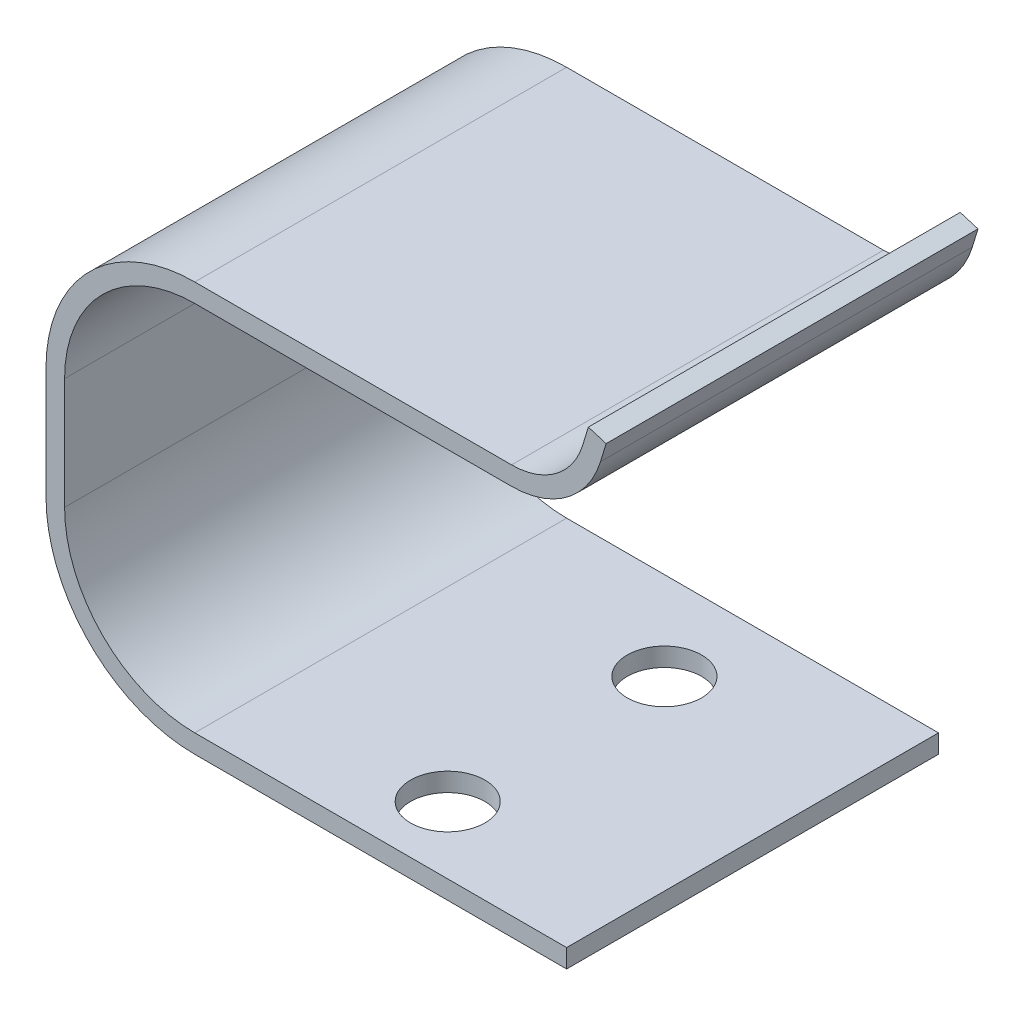
ISO-10303-21;
HEADER;
FILE_DESCRIPTION(('STEP AP214'),'2;1');
FILE_NAME('part.step','',(''),(''),'','','');
FILE_SCHEMA(('AUTOMOTIVE_DESIGN { 1 0 10303 214 1 1 1 1 }'));
ENDSEC;
DATA;
#1=APPLICATION_CONTEXT('core data for automotive mechanical design processes');
#2=APPLICATION_PROTOCOL_DEFINITION('international standard','automotive_design',2000,#1);
#3=PRODUCT_CONTEXT('',#1,'mechanical');
#4=PRODUCT('Part','Part','',(#3));
#5=PRODUCT_RELATED_PRODUCT_CATEGORY('part','',(#4));
#6=PRODUCT_DEFINITION_FORMATION('','',#4);
#7=PRODUCT_DEFINITION_CONTEXT('part definition',#1,'design');
#8=PRODUCT_DEFINITION('design','',#6,#7);
#9=PRODUCT_DEFINITION_SHAPE('','',#8);
#10=(LENGTH_UNIT() NAMED_UNIT(*) SI_UNIT(.MILLI.,.METRE.));
#11=(NAMED_UNIT(*) PLANE_ANGLE_UNIT() SI_UNIT($,.RADIAN.));
#12=(NAMED_UNIT(*) SI_UNIT($,.STERADIAN.) SOLID_ANGLE_UNIT());
#13=UNCERTAINTY_MEASURE_WITH_UNIT(LENGTH_MEASURE(1.E-05),#10,'distance_accuracy_value','');
#14=(GEOMETRIC_REPRESENTATION_CONTEXT(3) GLOBAL_UNCERTAINTY_ASSIGNED_CONTEXT((#13)) GLOBAL_UNIT_ASSIGNED_CONTEXT((#10,
#11,#12)) REPRESENTATION_CONTEXT('',''));
#15=CARTESIAN_POINT('',(0.,0.,0.));
#16=DIRECTION('',(0.,0.,1.));
#17=DIRECTION('',(1.,0.,0.));
#18=AXIS2_PLACEMENT_3D('',#15,#16,#17);
#19=CARTESIAN_POINT('',(1.82101102577767,24.5400968701397,20.));
#20=DIRECTION('',(-0.956424233307041,0.291980625972067,0.));
#21=DIRECTION('',(-0.291980625972067,-0.956424233307041,0.));
#22=AXIS2_PLACEMENT_3D('',#19,#20,#21);
#23=PLANE('',#22);
#24=DIRECTION('',(0.291980625972067,0.956424233307041,0.));
#25=VECTOR('',#24,1.);
#26=CARTESIAN_POINT('',(1.82101102577767,24.5400968701397,0.));
#27=LINE('',#26,#25);
#28=CARTESIAN_POINT('',(1.82101102577767,24.5400968701397,0.));
#29=VERTEX_POINT('',#28);
#30=CARTESIAN_POINT('',(2.12434673719531,25.5337163072561,0.));
#31=VERTEX_POINT('',#30);
#32=EDGE_CURVE('E178',#29,#31,#27,.T.);
#33=ORIENTED_EDGE('',*,*,#32,.T.);
#34=DIRECTION('',(0.,0.,-1.));
#35=VECTOR('',#34,1.);
#36=CARTESIAN_POINT('',(2.12434673719531,25.5337163072561,20.));
#37=LINE('',#36,#35);
#38=CARTESIAN_POINT('',(2.12434673719531,25.5337163072561,20.));
#39=VERTEX_POINT('',#38);
#40=EDGE_CURVE('E11',#39,#31,#37,.T.);
#41=ORIENTED_EDGE('',*,*,#40,.F.);
#42=DIRECTION('',(0.291980625972067,0.956424233307041,0.));
#43=VECTOR('',#42,1.);
#44=CARTESIAN_POINT('',(1.82101102577767,24.5400968701397,20.));
#45=LINE('',#44,#43);
#46=CARTESIAN_POINT('',(1.82101102577767,24.5400968701397,20.));
#47=VERTEX_POINT('',#46);
#48=EDGE_CURVE('E115',#47,#39,#45,.T.);
#49=ORIENTED_EDGE('',*,*,#48,.F.);
#50=DIRECTION('',(0.,0.,-1.));
#51=VECTOR('',#50,1.);
#52=CARTESIAN_POINT('',(1.82101102577767,24.5400968701397,20.));
#53=LINE('',#52,#51);
#54=EDGE_CURVE('E174',#47,#29,#53,.T.);
#55=ORIENTED_EDGE('',*,*,#54,.T.);
#56=EDGE_LOOP('',(#33,#41,#49,#55));
#57=FACE_BOUND('',#56,.T.);
#58=ADVANCED_FACE('F33',(#57),#23,.F.);
#59=CARTESIAN_POINT('',(1.16792250388827,25.8256969332282,20.));
#60=DIRECTION('',(0.291980625972067,0.956424233307041,0.));
#61=DIRECTION('',(-0.956424233307041,0.291980625972067,0.));
#62=AXIS2_PLACEMENT_3D('',#59,#60,#61);
#63=PLANE('',#62);
#64=DIRECTION('',(0.956424233307041,-0.291980625972067,0.));
#65=VECTOR('',#64,1.);
#66=CARTESIAN_POINT('',(1.16792250388827,25.8256969332282,0.));
#67=LINE('',#66,#65);
#68=CARTESIAN_POINT('',(1.16792250388827,25.8256969332282,0.));
#69=VERTEX_POINT('',#68);
#70=EDGE_CURVE('E181',#69,#31,#67,.T.);
#71=ORIENTED_EDGE('',*,*,#70,.F.);
#72=DIRECTION('',(0.,0.,-1.));
#73=VECTOR('',#72,1.);
#74=CARTESIAN_POINT('',(1.16792250388827,25.8256969332282,20.));
#75=LINE('',#74,#73);
#76=CARTESIAN_POINT('',(1.16792250388827,25.8256969332282,20.));
#77=VERTEX_POINT('',#76);
#78=EDGE_CURVE('E42',#77,#69,#75,.T.);
#79=ORIENTED_EDGE('',*,*,#78,.F.);
#80=DIRECTION('',(0.956424233307041,-0.291980625972067,0.));
#81=VECTOR('',#80,1.);
#82=CARTESIAN_POINT('',(1.16792250388827,25.8256969332282,20.));
#83=LINE('',#82,#81);
#84=EDGE_CURVE('E256',#77,#39,#83,.T.);
#85=ORIENTED_EDGE('',*,*,#84,.T.);
#86=ORIENTED_EDGE('',*,*,#40,.T.);
#87=EDGE_LOOP('',(#71,#79,#85,#86));
#88=FACE_BOUND('',#87,.T.);
#89=ADVANCED_FACE('F313',(#88),#63,.T.);
#90=CARTESIAN_POINT('',(0.864586792470628,24.8320774961118,20.));
#91=DIRECTION('',(-0.956424233307041,0.291980625972067,0.));
#92=DIRECTION('',(-0.291980625972067,-0.956424233307041,0.));
#93=AXIS2_PLACEMENT_3D('',#90,#91,#92);
#94=PLANE('',#93);
#95=DIRECTION('',(0.291980625972067,0.956424233307041,0.));
#96=VECTOR('',#95,1.);
#97=CARTESIAN_POINT('',(0.864586792470628,24.8320774961118,0.));
#98=LINE('',#97,#96);
#99=CARTESIAN_POINT('',(0.864586792470629,24.8320774961118,0.));
#100=VERTEX_POINT('',#99);
#101=EDGE_CURVE('E185',#100,#69,#98,.T.);
#102=ORIENTED_EDGE('',*,*,#101,.F.);
#103=DIRECTION('',(0.,0.,-1.));
#104=VECTOR('',#103,1.);
#105=CARTESIAN_POINT('',(0.864586792470629,24.8320774961118,20.));
#106=LINE('',#105,#104);
#107=CARTESIAN_POINT('',(0.864586792470629,24.8320774961118,20.));
#108=VERTEX_POINT('',#107);
#109=EDGE_CURVE('E241',#108,#100,#106,.T.);
#110=ORIENTED_EDGE('',*,*,#109,.F.);
#111=DIRECTION('',(0.291980625972067,0.956424233307041,0.));
#112=VECTOR('',#111,1.);
#113=CARTESIAN_POINT('',(0.864586792470628,24.8320774961118,20.));
#114=LINE('',#113,#112);
#115=EDGE_CURVE('E259',#108,#77,#114,.T.);
#116=ORIENTED_EDGE('',*,*,#115,.T.);
#117=ORIENTED_EDGE('',*,*,#78,.T.);
#118=EDGE_LOOP('',(#102,#110,#116,#117));
#119=FACE_BOUND('',#118,.T.);
#120=ADVANCED_FACE('F317',(#119),#94,.T.);
#121=CARTESIAN_POINT('',(-2.96111014075754,26.,20.));
#122=DIRECTION('',(0.,0.,-1.));
#123=DIRECTION('',(-1.,0.,0.));
#124=AXIS2_PLACEMENT_3D('',#121,#122,#123);
#125=CYLINDRICAL_SURFACE('',#124,4.);
#126=CARTESIAN_POINT('',(-2.96111014075754,26.,0.));
#127=DIRECTION('',(0.,0.,1.));
#128=DIRECTION('',(-1.,0.,0.));
#129=AXIS2_PLACEMENT_3D('',#126,#127,#128);
#130=CIRCLE('',#129,4.);
#131=CARTESIAN_POINT('',(-2.96111014075756,22.,0.));
#132=VERTEX_POINT('',#131);
#133=EDGE_CURVE('E188',#132,#100,#130,.T.);
#134=ORIENTED_EDGE('',*,*,#133,.F.);
#135=DIRECTION('',(0.,0.,-1.));
#136=VECTOR('',#135,1.);
#137=CARTESIAN_POINT('',(-2.96111014075756,22.,20.));
#138=LINE('',#137,#136);
#139=CARTESIAN_POINT('',(-2.96111014075756,22.,20.));
#140=VERTEX_POINT('',#139);
#141=EDGE_CURVE('E239',#140,#132,#138,.T.);
#142=ORIENTED_EDGE('',*,*,#141,.F.);
#143=CARTESIAN_POINT('',(-2.96111014075754,26.,20.));
#144=DIRECTION('',(0.,0.,1.));
#145=DIRECTION('',(-1.,0.,0.));
#146=AXIS2_PLACEMENT_3D('',#143,#144,#145);
#147=CIRCLE('',#146,4.);
#148=EDGE_CURVE('E262',#140,#108,#147,.T.);
#149=ORIENTED_EDGE('',*,*,#148,.T.);
#150=ORIENTED_EDGE('',*,*,#109,.T.);
#151=EDGE_LOOP('',(#134,#142,#149,#150));
#152=FACE_BOUND('',#151,.T.);
#153=ADVANCED_FACE('F322',(#152),#125,.F.);
#154=CARTESIAN_POINT('',(-20.,22.,20.));
#155=DIRECTION('',(0.,1.,0.));
#156=DIRECTION('',(0.,0.,1.));
#157=AXIS2_PLACEMENT_3D('',#154,#155,#156);
#158=PLANE('',#157);
#159=DIRECTION('',(1.,0.,0.));
#160=VECTOR('',#159,1.);
#161=CARTESIAN_POINT('',(-20.,22.,0.));
#162=LINE('',#161,#160);
#163=CARTESIAN_POINT('',(-20.,22.,0.));
#164=VERTEX_POINT('',#163);
#165=EDGE_CURVE('E191',#164,#132,#162,.T.);
#166=ORIENTED_EDGE('',*,*,#165,.F.);
#167=DIRECTION('',(0.,0.,-1.));
#168=VECTOR('',#167,1.);
#169=CARTESIAN_POINT('',(-20.,22.,20.));
#170=LINE('',#169,#168);
#171=CARTESIAN_POINT('',(-20.,22.,20.));
#172=VERTEX_POINT('',#171);
#173=EDGE_CURVE('E237',#172,#164,#170,.T.);
#174=ORIENTED_EDGE('',*,*,#173,.F.);
#175=DIRECTION('',(1.,0.,0.));
#176=VECTOR('',#175,1.);
#177=CARTESIAN_POINT('',(-20.,22.,20.));
#178=LINE('',#177,#176);
#179=EDGE_CURVE('E265',#172,#140,#178,.T.);
#180=ORIENTED_EDGE('',*,*,#179,.T.);
#181=ORIENTED_EDGE('',*,*,#141,.T.);
#182=EDGE_LOOP('',(#166,#174,#180,#181));
#183=FACE_BOUND('',#182,.T.);
#184=ADVANCED_FACE('F328',(#183),#158,.T.);
#185=CARTESIAN_POINT('',(-20.,14.,20.));
#186=DIRECTION('',(0.,0.,-1.));
#187=DIRECTION('',(-1.,0.,0.));
#188=AXIS2_PLACEMENT_3D('',#185,#186,#187);
#189=CYLINDRICAL_SURFACE('',#188,8.);
#190=CARTESIAN_POINT('',(-20.,14.,0.));
#191=DIRECTION('',(0.,0.,-1.));
#192=DIRECTION('',(-1.,0.,0.));
#193=AXIS2_PLACEMENT_3D('',#190,#191,#192);
#194=CIRCLE('',#193,8.);
#195=CARTESIAN_POINT('',(-28.,14.,0.));
#196=VERTEX_POINT('',#195);
#197=EDGE_CURVE('E194',#196,#164,#194,.T.);
#198=ORIENTED_EDGE('',*,*,#197,.F.);
#199=DIRECTION('',(0.,0.,-1.));
#200=VECTOR('',#199,1.);
#201=CARTESIAN_POINT('',(-28.,14.,20.));
#202=LINE('',#201,#200);
#203=CARTESIAN_POINT('',(-28.,14.,20.));
#204=VERTEX_POINT('',#203);
#205=EDGE_CURVE('E235',#204,#196,#202,.T.);
#206=ORIENTED_EDGE('',*,*,#205,.F.);
#207=CARTESIAN_POINT('',(-20.,14.,20.));
#208=DIRECTION('',(0.,0.,-1.));
#209=DIRECTION('',(-1.,0.,0.));
#210=AXIS2_PLACEMENT_3D('',#207,#208,#209);
#211=CIRCLE('',#210,8.);
#212=EDGE_CURVE('E268',#204,#172,#211,.T.);
#213=ORIENTED_EDGE('',*,*,#212,.T.);
#214=ORIENTED_EDGE('',*,*,#173,.T.);
#215=EDGE_LOOP('',(#198,#206,#213,#214));
#216=FACE_BOUND('',#215,.T.);
#217=ADVANCED_FACE('F332',(#216),#189,.T.);
#218=CARTESIAN_POINT('',(-28.,8.,20.));
#219=DIRECTION('',(-1.,0.,0.));
#220=DIRECTION('',(0.,0.,1.));
#221=AXIS2_PLACEMENT_3D('',#218,#219,#220);
#222=PLANE('',#221);
#223=DIRECTION('',(0.,1.,0.));
#224=VECTOR('',#223,1.);
#225=CARTESIAN_POINT('',(-28.,8.,0.));
#226=LINE('',#225,#224);
#227=CARTESIAN_POINT('',(-28.,8.,0.));
#228=VERTEX_POINT('',#227);
#229=EDGE_CURVE('E197',#228,#196,#226,.T.);
#230=ORIENTED_EDGE('',*,*,#229,.F.);
#231=DIRECTION('',(0.,0.,-1.));
#232=VECTOR('',#231,1.);
#233=CARTESIAN_POINT('',(-28.,8.,20.));
#234=LINE('',#233,#232);
#235=CARTESIAN_POINT('',(-28.,8.,20.));
#236=VERTEX_POINT('',#235);
#237=EDGE_CURVE('E233',#236,#228,#234,.T.);
#238=ORIENTED_EDGE('',*,*,#237,.F.);
#239=DIRECTION('',(0.,1.,0.));
#240=VECTOR('',#239,1.);
#241=CARTESIAN_POINT('',(-28.,8.,20.));
#242=LINE('',#241,#240);
#243=EDGE_CURVE('E271',#236,#204,#242,.T.);
#244=ORIENTED_EDGE('',*,*,#243,.T.);
#245=ORIENTED_EDGE('',*,*,#205,.T.);
#246=EDGE_LOOP('',(#230,#238,#244,#245));
#247=FACE_BOUND('',#246,.T.);
#248=ADVANCED_FACE('F336',(#247),#222,.T.);
#249=CARTESIAN_POINT('',(-20.,8.,20.));
#250=DIRECTION('',(0.,0.,-1.));
#251=DIRECTION('',(-1.,0.,0.));
#252=AXIS2_PLACEMENT_3D('',#249,#250,#251);
#253=CYLINDRICAL_SURFACE('',#252,8.);
#254=CARTESIAN_POINT('',(-20.,8.,0.));
#255=DIRECTION('',(0.,0.,-1.));
#256=DIRECTION('',(-1.,0.,0.));
#257=AXIS2_PLACEMENT_3D('',#254,#255,#256);
#258=CIRCLE('',#257,8.);
#259=CARTESIAN_POINT('',(-20.,0.,0.));
#260=VERTEX_POINT('',#259);
#261=EDGE_CURVE('E200',#260,#228,#258,.T.);
#262=ORIENTED_EDGE('',*,*,#261,.F.);
#263=DIRECTION('',(0.,0.,-1.));
#264=VECTOR('',#263,1.);
#265=CARTESIAN_POINT('',(-20.,0.,20.));
#266=LINE('',#265,#264);
#267=CARTESIAN_POINT('',(-20.,0.,20.));
#268=VERTEX_POINT('',#267);
#269=EDGE_CURVE('E231',#268,#260,#266,.T.);
#270=ORIENTED_EDGE('',*,*,#269,.F.);
#271=CARTESIAN_POINT('',(-20.,8.,20.));
#272=DIRECTION('',(0.,0.,-1.));
#273=DIRECTION('',(-1.,0.,0.));
#274=AXIS2_PLACEMENT_3D('',#271,#272,#273);
#275=CIRCLE('',#274,8.);
#276=EDGE_CURVE('E274',#268,#236,#275,.T.);
#277=ORIENTED_EDGE('',*,*,#276,.T.);
#278=ORIENTED_EDGE('',*,*,#237,.T.);
#279=EDGE_LOOP('',(#262,#270,#277,#278));
#280=FACE_BOUND('',#279,.T.);
#281=ADVANCED_FACE('F340',(#280),#253,.T.);
#282=CARTESIAN_POINT('',(0.,0.,20.));
#283=DIRECTION('',(0.,-1.,0.));
#284=DIRECTION('',(1.,0.,0.));
#285=AXIS2_PLACEMENT_3D('',#282,#283,#284);
#286=PLANE('',#285);
#287=CARTESIAN_POINT('',(-10.,0.,4.74155441829135));
#288=DIRECTION('',(0.,-1.,0.));
#289=DIRECTION('',(1.,0.,0.));
#290=AXIS2_PLACEMENT_3D('',#287,#288,#289);
#291=CIRCLE('',#290,2.);
#292=CARTESIAN_POINT('',(-8.,0.,4.74155441829135));
#293=VERTEX_POINT('',#292);
#294=EDGE_CURVE('E252',#293,#293,#291,.T.);
#295=ORIENTED_EDGE('',*,*,#294,.F.);
#296=EDGE_LOOP('',(#295));
#297=FACE_BOUND('',#296,.T.);
#298=CARTESIAN_POINT('',(-10.,0.,16.3954067885648));
#299=DIRECTION('',(0.,-1.,0.));
#300=DIRECTION('',(1.,0.,0.));
#301=AXIS2_PLACEMENT_3D('',#298,#299,#300);
#302=CIRCLE('',#301,2.);
#303=CARTESIAN_POINT('',(-8.,0.,16.3954067885648));
#304=VERTEX_POINT('',#303);
#305=EDGE_CURVE('E244',#304,#304,#302,.T.);
#306=ORIENTED_EDGE('',*,*,#305,.F.);
#307=EDGE_LOOP('',(#306));
#308=FACE_BOUND('',#307,.T.);
#309=DIRECTION('',(-1.,0.,0.));
#310=VECTOR('',#309,1.);
#311=CARTESIAN_POINT('',(0.,0.,0.));
#312=LINE('',#311,#310);
#313=CARTESIAN_POINT('',(0.,0.,0.));
#314=VERTEX_POINT('',#313);
#315=EDGE_CURVE('E203',#314,#260,#312,.T.);
#316=ORIENTED_EDGE('',*,*,#315,.F.);
#317=DIRECTION('',(0.,0.,-1.));
#318=VECTOR('',#317,1.);
#319=CARTESIAN_POINT('',(0.,0.,20.));
#320=LINE('',#319,#318);
#321=CARTESIAN_POINT('',(0.,0.,20.));
#322=VERTEX_POINT('',#321);
#323=EDGE_CURVE('E229',#322,#314,#320,.T.);
#324=ORIENTED_EDGE('',*,*,#323,.F.);
#325=DIRECTION('',(-1.,0.,0.));
#326=VECTOR('',#325,1.);
#327=CARTESIAN_POINT('',(0.,0.,20.));
#328=LINE('',#327,#326);
#329=EDGE_CURVE('E277',#322,#268,#328,.T.);
#330=ORIENTED_EDGE('',*,*,#329,.T.);
#331=ORIENTED_EDGE('',*,*,#269,.T.);
#332=EDGE_LOOP('',(#316,#324,#330,#331));
#333=FACE_BOUND('',#332,.T.);
#334=ADVANCED_FACE('F344',(#297,#308,#333),#286,.T.);
#335=CARTESIAN_POINT('',(0.,1.,20.));
#336=DIRECTION('',(1.,0.,0.));
#337=DIRECTION('',(0.,1.,0.));
#338=AXIS2_PLACEMENT_3D('',#335,#336,#337);
#339=PLANE('',#338);
#340=DIRECTION('',(0.,-1.,0.));
#341=VECTOR('',#340,1.);
#342=CARTESIAN_POINT('',(0.,1.,0.));
#343=LINE('',#342,#341);
#344=CARTESIAN_POINT('',(0.,1.,0.));
#345=VERTEX_POINT('',#344);
#346=EDGE_CURVE('E206',#345,#314,#343,.T.);
#347=ORIENTED_EDGE('',*,*,#346,.F.);
#348=DIRECTION('',(0.,0.,-1.));
#349=VECTOR('',#348,1.);
#350=CARTESIAN_POINT('',(0.,1.,20.));
#351=LINE('',#350,#349);
#352=CARTESIAN_POINT('',(0.,1.,20.));
#353=VERTEX_POINT('',#352);
#354=EDGE_CURVE('E227',#353,#345,#351,.T.);
#355=ORIENTED_EDGE('',*,*,#354,.F.);
#356=DIRECTION('',(0.,-1.,0.));
#357=VECTOR('',#356,1.);
#358=CARTESIAN_POINT('',(0.,1.,20.));
#359=LINE('',#358,#357);
#360=EDGE_CURVE('E280',#353,#322,#359,.T.);
#361=ORIENTED_EDGE('',*,*,#360,.T.);
#362=ORIENTED_EDGE('',*,*,#323,.T.);
#363=EDGE_LOOP('',(#347,#355,#361,#362));
#364=FACE_BOUND('',#363,.T.);
#365=ADVANCED_FACE('F348',(#364),#339,.T.);
#366=CARTESIAN_POINT('',(0.,1.,20.));
#367=DIRECTION('',(0.,-1.,0.));
#368=DIRECTION('',(1.,0.,0.));
#369=AXIS2_PLACEMENT_3D('',#366,#367,#368);
#370=PLANE('',#369);
#371=CARTESIAN_POINT('',(-10.,0.999999999999999,4.74155441829135));
#372=DIRECTION('',(0.,-1.,0.));
#373=DIRECTION('',(1.,0.,0.));
#374=AXIS2_PLACEMENT_3D('',#371,#372,#373);
#375=CIRCLE('',#374,2.);
#376=CARTESIAN_POINT('',(-8.,0.999999999999999,4.74155441829135));
#377=VERTEX_POINT('',#376);
#378=EDGE_CURVE('E36',#377,#377,#375,.T.);
#379=ORIENTED_EDGE('',*,*,#378,.T.);
#380=EDGE_LOOP('',(#379));
#381=FACE_BOUND('',#380,.T.);
#382=CARTESIAN_POINT('',(-10.,0.999999999999999,16.3954067885648));
#383=DIRECTION('',(0.,-1.,0.));
#384=DIRECTION('',(1.,0.,0.));
#385=AXIS2_PLACEMENT_3D('',#382,#383,#384);
#386=CIRCLE('',#385,2.);
#387=CARTESIAN_POINT('',(-8.,0.999999999999999,16.3954067885648));
#388=VERTEX_POINT('',#387);
#389=EDGE_CURVE('E182',#388,#388,#386,.T.);
#390=ORIENTED_EDGE('',*,*,#389,.T.);
#391=EDGE_LOOP('',(#390));
#392=FACE_BOUND('',#391,.T.);
#393=DIRECTION('',(-1.,0.,0.));
#394=VECTOR('',#393,1.);
#395=CARTESIAN_POINT('',(0.,1.,0.));
#396=LINE('',#395,#394);
#397=CARTESIAN_POINT('',(-20.,0.999999999999998,0.));
#398=VERTEX_POINT('',#397);
#399=EDGE_CURVE('E209',#345,#398,#396,.T.);
#400=ORIENTED_EDGE('',*,*,#399,.T.);
#401=DIRECTION('',(0.,0.,-1.));
#402=VECTOR('',#401,1.);
#403=CARTESIAN_POINT('',(-20.,0.999999999999998,20.));
#404=LINE('',#403,#402);
#405=CARTESIAN_POINT('',(-20.,0.999999999999998,20.));
#406=VERTEX_POINT('',#405);
#407=EDGE_CURVE('E224',#406,#398,#404,.T.);
#408=ORIENTED_EDGE('',*,*,#407,.F.);
#409=DIRECTION('',(-1.,0.,0.));
#410=VECTOR('',#409,1.);
#411=CARTESIAN_POINT('',(0.,1.,20.));
#412=LINE('',#411,#410);
#413=EDGE_CURVE('E283',#353,#406,#412,.T.);
#414=ORIENTED_EDGE('',*,*,#413,.F.);
#415=ORIENTED_EDGE('',*,*,#354,.T.);
#416=EDGE_LOOP('',(#400,#408,#414,#415));
#417=FACE_BOUND('',#416,.T.);
#418=ADVANCED_FACE('F352',(#381,#392,#417),#370,.F.);
#419=CARTESIAN_POINT('',(-20.,8.,20.));
#420=DIRECTION('',(0.,0.,-1.));
#421=DIRECTION('',(-1.,0.,0.));
#422=AXIS2_PLACEMENT_3D('',#419,#420,#421);
#423=CYLINDRICAL_SURFACE('',#422,7.);
#424=CARTESIAN_POINT('',(-20.,8.,0.));
#425=DIRECTION('',(0.,0.,1.));
#426=DIRECTION('',(1.,0.,0.));
#427=AXIS2_PLACEMENT_3D('',#424,#425,#426);
#428=CIRCLE('',#427,7.);
#429=CARTESIAN_POINT('',(-27.,8.,0.));
#430=VERTEX_POINT('',#429);
#431=EDGE_CURVE('E211',#398,#430,#428,.F.);
#432=ORIENTED_EDGE('',*,*,#431,.T.);
#433=DIRECTION('',(0.,0.,-1.));
#434=VECTOR('',#433,1.);
#435=CARTESIAN_POINT('',(-27.,8.,20.));
#436=LINE('',#435,#434);
#437=CARTESIAN_POINT('',(-27.,8.,20.));
#438=VERTEX_POINT('',#437);
#439=EDGE_CURVE('E221',#438,#430,#436,.T.);
#440=ORIENTED_EDGE('',*,*,#439,.F.);
#441=CARTESIAN_POINT('',(-20.,8.,20.));
#442=DIRECTION('',(0.,0.,1.));
#443=DIRECTION('',(1.,0.,0.));
#444=AXIS2_PLACEMENT_3D('',#441,#442,#443);
#445=CIRCLE('',#444,7.);
#446=EDGE_CURVE('E285',#406,#438,#445,.F.);
#447=ORIENTED_EDGE('',*,*,#446,.F.);
#448=ORIENTED_EDGE('',*,*,#407,.T.);
#449=EDGE_LOOP('',(#432,#440,#447,#448));
#450=FACE_BOUND('',#449,.T.);
#451=ADVANCED_FACE('F292',(#450),#423,.F.);
#452=CARTESIAN_POINT('',(-27.,8.,20.));
#453=DIRECTION('',(-1.,0.,0.));
#454=DIRECTION('',(0.,0.,1.));
#455=AXIS2_PLACEMENT_3D('',#452,#453,#454);
#456=PLANE('',#455);
#457=DIRECTION('',(0.,1.,0.));
#458=VECTOR('',#457,1.);
#459=CARTESIAN_POINT('',(-27.,8.,0.));
#460=LINE('',#459,#458);
#461=CARTESIAN_POINT('',(-27.,14.,0.));
#462=VERTEX_POINT('',#461);
#463=EDGE_CURVE('E213',#430,#462,#460,.T.);
#464=ORIENTED_EDGE('',*,*,#463,.T.);
#465=DIRECTION('',(0.,0.,-1.));
#466=VECTOR('',#465,1.);
#467=CARTESIAN_POINT('',(-27.,14.,20.));
#468=LINE('',#467,#466);
#469=CARTESIAN_POINT('',(-27.,14.,20.));
#470=VERTEX_POINT('',#469);
#471=EDGE_CURVE('E169',#470,#462,#468,.T.);
#472=ORIENTED_EDGE('',*,*,#471,.F.);
#473=DIRECTION('',(0.,1.,0.));
#474=VECTOR('',#473,1.);
#475=CARTESIAN_POINT('',(-27.,8.,20.));
#476=LINE('',#475,#474);
#477=EDGE_CURVE('E160',#438,#470,#476,.T.);
#478=ORIENTED_EDGE('',*,*,#477,.F.);
#479=ORIENTED_EDGE('',*,*,#439,.T.);
#480=EDGE_LOOP('',(#464,#472,#478,#479));
#481=FACE_BOUND('',#480,.T.);
#482=ADVANCED_FACE('F296',(#481),#456,.F.);
#483=CARTESIAN_POINT('',(-20.,14.,20.));
#484=DIRECTION('',(0.,0.,-1.));
#485=DIRECTION('',(-1.,0.,0.));
#486=AXIS2_PLACEMENT_3D('',#483,#484,#485);
#487=CYLINDRICAL_SURFACE('',#486,7.);
#488=CARTESIAN_POINT('',(-20.,14.,0.));
#489=DIRECTION('',(0.,0.,1.));
#490=DIRECTION('',(1.,0.,0.));
#491=AXIS2_PLACEMENT_3D('',#488,#489,#490);
#492=CIRCLE('',#491,7.);
#493=CARTESIAN_POINT('',(-20.,21.,0.));
#494=VERTEX_POINT('',#493);
#495=EDGE_CURVE('E168',#462,#494,#492,.F.);
#496=ORIENTED_EDGE('',*,*,#495,.T.);
#497=DIRECTION('',(0.,0.,-1.));
#498=VECTOR('',#497,1.);
#499=CARTESIAN_POINT('',(-20.,21.,20.));
#500=LINE('',#499,#498);
#501=CARTESIAN_POINT('',(-20.,21.,20.));
#502=VERTEX_POINT('',#501);
#503=EDGE_CURVE('E165',#502,#494,#500,.T.);
#504=ORIENTED_EDGE('',*,*,#503,.F.);
#505=CARTESIAN_POINT('',(-20.,14.,20.));
#506=DIRECTION('',(0.,0.,1.));
#507=DIRECTION('',(1.,0.,0.));
#508=AXIS2_PLACEMENT_3D('',#505,#506,#507);
#509=CIRCLE('',#508,7.);
#510=EDGE_CURVE('E154',#470,#502,#509,.F.);
#511=ORIENTED_EDGE('',*,*,#510,.F.);
#512=ORIENTED_EDGE('',*,*,#471,.T.);
#513=EDGE_LOOP('',(#496,#504,#511,#512));
#514=FACE_BOUND('',#513,.T.);
#515=ADVANCED_FACE('F166',(#514),#487,.F.);
#516=CARTESIAN_POINT('',(-20.,21.,20.));
#517=DIRECTION('',(0.,1.,0.));
#518=DIRECTION('',(0.,0.,1.));
#519=AXIS2_PLACEMENT_3D('',#516,#517,#518);
#520=PLANE('',#519);
#521=DIRECTION('',(1.,0.,0.));
#522=VECTOR('',#521,1.);
#523=CARTESIAN_POINT('',(-20.,21.,0.));
#524=LINE('',#523,#522);
#525=CARTESIAN_POINT('',(-2.96111014075757,21.,0.));
#526=VERTEX_POINT('',#525);
#527=EDGE_CURVE('E103',#494,#526,#524,.T.);
#528=ORIENTED_EDGE('',*,*,#527,.T.);
#529=DIRECTION('',(0.,0.,-1.));
#530=VECTOR('',#529,1.);
#531=CARTESIAN_POINT('',(-2.96111014075757,21.,20.));
#532=LINE('',#531,#530);
#533=CARTESIAN_POINT('',(-2.96111014075757,21.,20.));
#534=VERTEX_POINT('',#533);
#535=EDGE_CURVE('E170',#534,#526,#532,.T.);
#536=ORIENTED_EDGE('',*,*,#535,.F.);
#537=DIRECTION('',(1.,0.,0.));
#538=VECTOR('',#537,1.);
#539=CARTESIAN_POINT('',(-20.,21.,20.));
#540=LINE('',#539,#538);
#541=EDGE_CURVE('E158',#502,#534,#540,.T.);
#542=ORIENTED_EDGE('',*,*,#541,.F.);
#543=ORIENTED_EDGE('',*,*,#503,.T.);
#544=EDGE_LOOP('',(#528,#536,#542,#543));
#545=FACE_BOUND('',#544,.T.);
#546=ADVANCED_FACE('F172',(#545),#520,.F.);
#547=CARTESIAN_POINT('',(-2.96111014075754,26.,20.));
#548=DIRECTION('',(0.,0.,-1.));
#549=DIRECTION('',(-1.,0.,0.));
#550=AXIS2_PLACEMENT_3D('',#547,#548,#549);
#551=CYLINDRICAL_SURFACE('',#550,5.);
#552=CARTESIAN_POINT('',(-2.96111014075754,26.,0.));
#553=DIRECTION('',(0.,0.,1.));
#554=DIRECTION('',(1.,0.,0.));
#555=AXIS2_PLACEMENT_3D('',#552,#553,#554);
#556=CIRCLE('',#555,5.);
#557=EDGE_CURVE('E109',#526,#29,#556,.T.);
#558=ORIENTED_EDGE('',*,*,#557,.T.);
#559=ORIENTED_EDGE('',*,*,#54,.F.);
#560=CARTESIAN_POINT('',(-2.96111014075754,26.,20.));
#561=DIRECTION('',(0.,0.,1.));
#562=DIRECTION('',(1.,0.,0.));
#563=AXIS2_PLACEMENT_3D('',#560,#561,#562);
#564=CIRCLE('',#563,5.);
#565=EDGE_CURVE('E51',#534,#47,#564,.T.);
#566=ORIENTED_EDGE('',*,*,#565,.F.);
#567=ORIENTED_EDGE('',*,*,#535,.T.);
#568=EDGE_LOOP('',(#558,#559,#566,#567));
#569=FACE_BOUND('',#568,.T.);
#570=ADVANCED_FACE('F302',(#569),#551,.T.);
#571=CARTESIAN_POINT('',(-2.96111014075754,26.,20.));
#572=DIRECTION('',(0.,0.,1.));
#573=DIRECTION('',(1.,0.,0.));
#574=AXIS2_PLACEMENT_3D('',#571,#572,#573);
#575=PLANE('',#574);
#576=ORIENTED_EDGE('',*,*,#48,.T.);
#577=ORIENTED_EDGE('',*,*,#84,.F.);
#578=ORIENTED_EDGE('',*,*,#115,.F.);
#579=ORIENTED_EDGE('',*,*,#148,.F.);
#580=ORIENTED_EDGE('',*,*,#179,.F.);
#581=ORIENTED_EDGE('',*,*,#212,.F.);
#582=ORIENTED_EDGE('',*,*,#243,.F.);
#583=ORIENTED_EDGE('',*,*,#276,.F.);
#584=ORIENTED_EDGE('',*,*,#329,.F.);
#585=ORIENTED_EDGE('',*,*,#360,.F.);
#586=ORIENTED_EDGE('',*,*,#413,.T.);
#587=ORIENTED_EDGE('',*,*,#446,.T.);
#588=ORIENTED_EDGE('',*,*,#477,.T.);
#589=ORIENTED_EDGE('',*,*,#510,.T.);
#590=ORIENTED_EDGE('',*,*,#541,.T.);
#591=ORIENTED_EDGE('',*,*,#565,.T.);
#592=EDGE_LOOP('',(#576,#577,#578,#579,#580,#581,#582,#583,#584,#585,#586,#587,#588,#589,#590,#591));
#593=FACE_BOUND('',#592,.T.);
#594=ADVANCED_FACE('F156',(#593),#575,.T.);
#595=CARTESIAN_POINT('',(-2.96111014075754,26.,0.));
#596=DIRECTION('',(0.,0.,1.));
#597=DIRECTION('',(1.,0.,0.));
#598=AXIS2_PLACEMENT_3D('',#595,#596,#597);
#599=PLANE('',#598);
#600=ORIENTED_EDGE('',*,*,#32,.F.);
#601=ORIENTED_EDGE('',*,*,#557,.F.);
#602=ORIENTED_EDGE('',*,*,#527,.F.);
#603=ORIENTED_EDGE('',*,*,#495,.F.);
#604=ORIENTED_EDGE('',*,*,#463,.F.);
#605=ORIENTED_EDGE('',*,*,#431,.F.);
#606=ORIENTED_EDGE('',*,*,#399,.F.);
#607=ORIENTED_EDGE('',*,*,#346,.T.);
#608=ORIENTED_EDGE('',*,*,#315,.T.);
#609=ORIENTED_EDGE('',*,*,#261,.T.);
#610=ORIENTED_EDGE('',*,*,#229,.T.);
#611=ORIENTED_EDGE('',*,*,#197,.T.);
#612=ORIENTED_EDGE('',*,*,#165,.T.);
#613=ORIENTED_EDGE('',*,*,#133,.T.);
#614=ORIENTED_EDGE('',*,*,#101,.T.);
#615=ORIENTED_EDGE('',*,*,#70,.T.);
#616=EDGE_LOOP('',(#600,#601,#602,#603,#604,#605,#606,#607,#608,#609,#610,#611,#612,#613,#614,#615));
#617=FACE_BOUND('',#616,.T.);
#618=ADVANCED_FACE('F299',(#617),#599,.F.);
#619=CARTESIAN_POINT('',(-10.,10.,16.3954067885648));
#620=DIRECTION('',(0.,-1.,0.));
#621=DIRECTION('',(1.,0.,0.));
#622=AXIS2_PLACEMENT_3D('',#619,#620,#621);
#623=CYLINDRICAL_SURFACE('',#622,2.);
#624=ORIENTED_EDGE('',*,*,#305,.T.);
#625=EDGE_LOOP('',(#624));
#626=FACE_BOUND('',#625,.T.);
#627=ORIENTED_EDGE('',*,*,#389,.F.);
#628=EDGE_LOOP('',(#627));
#629=FACE_BOUND('',#628,.T.);
#630=ADVANCED_FACE('F389',(#626,#629),#623,.F.);
#631=CARTESIAN_POINT('',(-10.,10.,4.74155441829135));
#632=DIRECTION('',(0.,-1.,0.));
#633=DIRECTION('',(1.,0.,0.));
#634=AXIS2_PLACEMENT_3D('',#631,#632,#633);
#635=CYLINDRICAL_SURFACE('',#634,2.);
#636=ORIENTED_EDGE('',*,*,#294,.T.);
#637=EDGE_LOOP('',(#636));
#638=FACE_BOUND('',#637,.T.);
#639=ORIENTED_EDGE('',*,*,#378,.F.);
#640=EDGE_LOOP('',(#639));
#641=FACE_BOUND('',#640,.T.);
#642=ADVANCED_FACE('F412',(#638,#641),#635,.F.);
#643=CLOSED_SHELL('',(#58,#89,#120,#153,#184,#217,#248,#281,#334,#365,#418,#451,#482,#515,#546,
#570,#594,#618,#630,#642));
#644=MANIFOLD_SOLID_BREP('B2',#643);
#645=ADVANCED_BREP_SHAPE_REPRESENTATION('',(#18,#644),#14);
#646=SHAPE_DEFINITION_REPRESENTATION(#9,#645);
ENDSEC;
END-ISO-10303-21;
